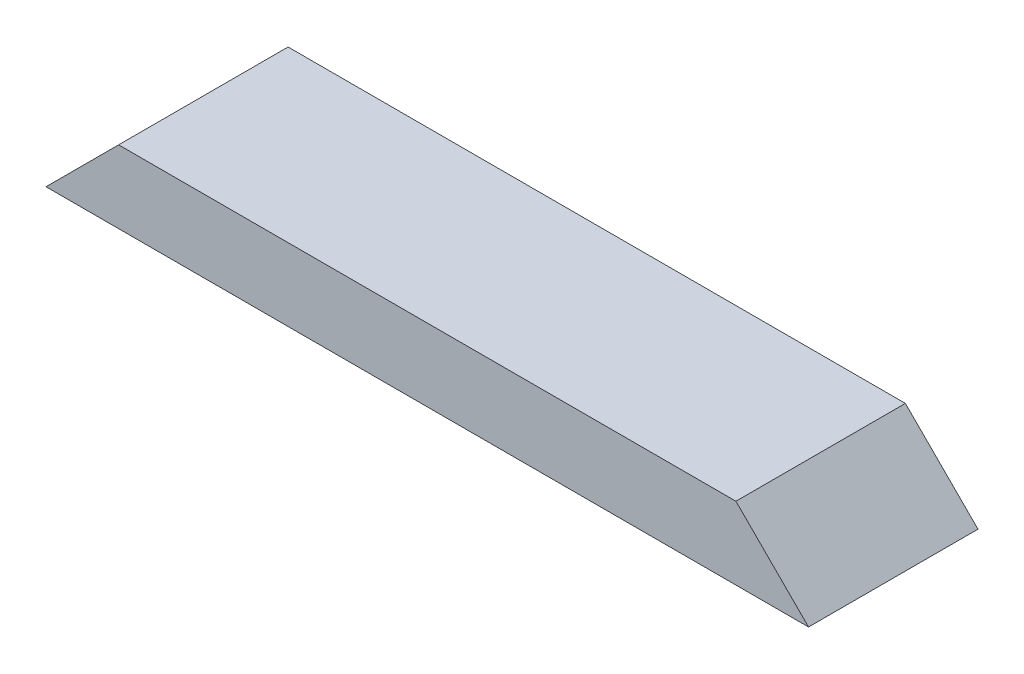
ISO-10303-21;
HEADER;
FILE_DESCRIPTION(('STEP AP214'),'2;1');
FILE_NAME('part.step','',(''),(''),'','','');
FILE_SCHEMA(('AUTOMOTIVE_DESIGN { 1 0 10303 214 1 1 1 1 }'));
ENDSEC;
DATA;
#1=APPLICATION_CONTEXT('core data for automotive mechanical design processes');
#2=APPLICATION_PROTOCOL_DEFINITION('international standard','automotive_design',2000,#1);
#3=PRODUCT_CONTEXT('',#1,'mechanical');
#4=PRODUCT('Part','Part','',(#3));
#5=PRODUCT_RELATED_PRODUCT_CATEGORY('part','',(#4));
#6=PRODUCT_DEFINITION_FORMATION('','',#4);
#7=PRODUCT_DEFINITION_CONTEXT('part definition',#1,'design');
#8=PRODUCT_DEFINITION('design','',#6,#7);
#9=PRODUCT_DEFINITION_SHAPE('','',#8);
#10=(LENGTH_UNIT() NAMED_UNIT(*) SI_UNIT(.MILLI.,.METRE.));
#11=(NAMED_UNIT(*) PLANE_ANGLE_UNIT() SI_UNIT($,.RADIAN.));
#12=(NAMED_UNIT(*) SI_UNIT($,.STERADIAN.) SOLID_ANGLE_UNIT());
#13=UNCERTAINTY_MEASURE_WITH_UNIT(LENGTH_MEASURE(1.E-05),#10,'distance_accuracy_value','');
#14=(GEOMETRIC_REPRESENTATION_CONTEXT(3) GLOBAL_UNCERTAINTY_ASSIGNED_CONTEXT((#13)) GLOBAL_UNIT_ASSIGNED_CONTEXT((#10,
#11,#12)) REPRESENTATION_CONTEXT('',''));
#15=CARTESIAN_POINT('',(0.,0.,0.));
#16=DIRECTION('',(0.,0.,1.));
#17=DIRECTION('',(1.,0.,0.));
#18=AXIS2_PLACEMENT_3D('',#15,#16,#17);
#19=CARTESIAN_POINT('',(0.,38.1,0.));
#20=DIRECTION('',(0.,0.,-1.));
#21=DIRECTION('',(-1.,0.,0.));
#22=AXIS2_PLACEMENT_3D('',#19,#20,#21);
#23=PLANE('',#22);
#24=DIRECTION('',(1.,0.,0.));
#25=VECTOR('',#24,1.);
#26=CARTESIAN_POINT('',(0.,38.1,0.));
#27=LINE('',#26,#25);
#28=CARTESIAN_POINT('',(38.1,38.1,0.));
#29=VERTEX_POINT('',#28);
#30=CARTESIAN_POINT('',(361.95,38.0999999999999,0.));
#31=VERTEX_POINT('',#30);
#32=EDGE_CURVE('E47',#29,#31,#27,.T.);
#33=ORIENTED_EDGE('',*,*,#32,.F.);
#34=DIRECTION('',(0.707106781186547,0.707106781186547,0.));
#35=VECTOR('',#34,1.);
#36=CARTESIAN_POINT('',(0.,0.,0.));
#37=LINE('',#36,#35);
#38=CARTESIAN_POINT('',(0.,0.,0.));
#39=VERTEX_POINT('',#38);
#40=EDGE_CURVE('E82',#39,#29,#37,.T.);
#41=ORIENTED_EDGE('',*,*,#40,.F.);
#42=DIRECTION('',(1.,0.,0.));
#43=VECTOR('',#42,1.);
#44=CARTESIAN_POINT('',(0.,0.,0.));
#45=LINE('',#44,#43);
#46=CARTESIAN_POINT('',(400.05,0.,0.));
#47=VERTEX_POINT('',#46);
#48=EDGE_CURVE('E87',#39,#47,#45,.T.);
#49=ORIENTED_EDGE('',*,*,#48,.T.);
#50=DIRECTION('',(0.707106781186549,-0.707106781186546,0.));
#51=VECTOR('',#50,1.);
#52=CARTESIAN_POINT('',(361.95,38.0999999999999,0.));
#53=LINE('',#52,#51);
#54=EDGE_CURVE('E63',#31,#47,#53,.T.);
#55=ORIENTED_EDGE('',*,*,#54,.F.);
#56=EDGE_LOOP('',(#33,#41,#49,#55));
#57=FACE_BOUND('',#56,.T.);
#58=ADVANCED_FACE('F39',(#57),#23,.F.);
#59=CARTESIAN_POINT('',(0.,38.1,-88.9));
#60=DIRECTION('',(0.,0.,1.));
#61=DIRECTION('',(1.,0.,0.));
#62=AXIS2_PLACEMENT_3D('',#59,#60,#61);
#63=PLANE('',#62);
#64=DIRECTION('',(-1.,0.,0.));
#65=VECTOR('',#64,1.);
#66=CARTESIAN_POINT('',(0.,0.,-88.9));
#67=LINE('',#66,#65);
#68=CARTESIAN_POINT('',(400.05,0.,-88.9));
#69=VERTEX_POINT('',#68);
#70=CARTESIAN_POINT('',(0.,0.,-88.9));
#71=VERTEX_POINT('',#70);
#72=EDGE_CURVE('E42',#69,#71,#67,.T.);
#73=ORIENTED_EDGE('',*,*,#72,.T.);
#74=DIRECTION('',(0.707106781186547,0.707106781186547,0.));
#75=VECTOR('',#74,1.);
#76=CARTESIAN_POINT('',(0.,0.,-88.9));
#77=LINE('',#76,#75);
#78=CARTESIAN_POINT('',(38.1,38.1,-88.9));
#79=VERTEX_POINT('',#78);
#80=EDGE_CURVE('E55',#71,#79,#77,.T.);
#81=ORIENTED_EDGE('',*,*,#80,.T.);
#82=DIRECTION('',(-1.,0.,0.));
#83=VECTOR('',#82,1.);
#84=CARTESIAN_POINT('',(0.,38.1,-88.9));
#85=LINE('',#84,#83);
#86=CARTESIAN_POINT('',(361.95,38.0999999999999,-88.9));
#87=VERTEX_POINT('',#86);
#88=EDGE_CURVE('E11',#87,#79,#85,.T.);
#89=ORIENTED_EDGE('',*,*,#88,.F.);
#90=DIRECTION('',(0.707106781186549,-0.707106781186546,0.));
#91=VECTOR('',#90,1.);
#92=CARTESIAN_POINT('',(361.95,38.0999999999999,-88.9));
#93=LINE('',#92,#91);
#94=EDGE_CURVE('E100',#87,#69,#93,.T.);
#95=ORIENTED_EDGE('',*,*,#94,.T.);
#96=EDGE_LOOP('',(#73,#81,#89,#95));
#97=FACE_BOUND('',#96,.T.);
#98=ADVANCED_FACE('F109',(#97),#63,.F.);
#99=CARTESIAN_POINT('',(0.,38.1,0.));
#100=DIRECTION('',(0.,-1.,0.));
#101=DIRECTION('',(0.,0.,-1.));
#102=AXIS2_PLACEMENT_3D('',#99,#100,#101);
#103=PLANE('',#102);
#104=ORIENTED_EDGE('',*,*,#88,.T.);
#105=DIRECTION('',(0.,0.,1.));
#106=VECTOR('',#105,1.);
#107=CARTESIAN_POINT('',(38.1,38.1,-88.9));
#108=LINE('',#107,#106);
#109=EDGE_CURVE('E88',#79,#29,#108,.T.);
#110=ORIENTED_EDGE('',*,*,#109,.T.);
#111=ORIENTED_EDGE('',*,*,#32,.T.);
#112=DIRECTION('',(0.,0.,1.));
#113=VECTOR('',#112,1.);
#114=CARTESIAN_POINT('',(361.95,38.0999999999999,-88.9));
#115=LINE('',#114,#113);
#116=EDGE_CURVE('E103',#87,#31,#115,.T.);
#117=ORIENTED_EDGE('',*,*,#116,.F.);
#118=EDGE_LOOP('',(#104,#110,#111,#117));
#119=FACE_BOUND('',#118,.T.);
#120=ADVANCED_FACE('F112',(#119),#103,.F.);
#121=CARTESIAN_POINT('',(0.,0.,0.));
#122=DIRECTION('',(0.,-1.,0.));
#123=DIRECTION('',(0.,0.,-1.));
#124=AXIS2_PLACEMENT_3D('',#121,#122,#123);
#125=PLANE('',#124);
#126=DIRECTION('',(0.,0.,1.));
#127=VECTOR('',#126,1.);
#128=CARTESIAN_POINT('',(0.,0.,0.));
#129=LINE('',#128,#127);
#130=EDGE_CURVE('E79',#71,#39,#129,.T.);
#131=ORIENTED_EDGE('',*,*,#130,.F.);
#132=ORIENTED_EDGE('',*,*,#72,.F.);
#133=DIRECTION('',(0.,0.,-1.));
#134=VECTOR('',#133,1.);
#135=CARTESIAN_POINT('',(400.05,0.,0.));
#136=LINE('',#135,#134);
#137=EDGE_CURVE('E96',#47,#69,#136,.T.);
#138=ORIENTED_EDGE('',*,*,#137,.F.);
#139=ORIENTED_EDGE('',*,*,#48,.F.);
#140=EDGE_LOOP('',(#131,#132,#138,#139));
#141=FACE_BOUND('',#140,.T.);
#142=ADVANCED_FACE('F95',(#141),#125,.T.);
#143=CARTESIAN_POINT('',(361.95,38.0999999999999,-88.9));
#144=DIRECTION('',(-0.707106781186546,-0.707106781186549,0.));
#145=DIRECTION('',(0.707106781186549,-0.707106781186546,0.));
#146=AXIS2_PLACEMENT_3D('',#143,#144,#145);
#147=PLANE('',#146);
#148=ORIENTED_EDGE('',*,*,#54,.T.);
#149=ORIENTED_EDGE('',*,*,#137,.T.);
#150=ORIENTED_EDGE('',*,*,#94,.F.);
#151=ORIENTED_EDGE('',*,*,#116,.T.);
#152=EDGE_LOOP('',(#148,#149,#150,#151));
#153=FACE_BOUND('',#152,.T.);
#154=ADVANCED_FACE('F113',(#153),#147,.F.);
#155=CARTESIAN_POINT('',(0.,0.,-88.9));
#156=DIRECTION('',(0.707106781186547,-0.707106781186547,0.));
#157=DIRECTION('',(0.707106781186548,0.707106781186548,0.));
#158=AXIS2_PLACEMENT_3D('',#155,#156,#157);
#159=PLANE('',#158);
#160=ORIENTED_EDGE('',*,*,#40,.T.);
#161=ORIENTED_EDGE('',*,*,#109,.F.);
#162=ORIENTED_EDGE('',*,*,#80,.F.);
#163=ORIENTED_EDGE('',*,*,#130,.T.);
#164=EDGE_LOOP('',(#160,#161,#162,#163));
#165=FACE_BOUND('',#164,.T.);
#166=ADVANCED_FACE('F81',(#165),#159,.F.);
#167=CLOSED_SHELL('',(#58,#98,#120,#142,#154,#166));
#168=MANIFOLD_SOLID_BREP('B2',#167);
#169=ADVANCED_BREP_SHAPE_REPRESENTATION('',(#18,#168),#14);
#170=SHAPE_DEFINITION_REPRESENTATION(#9,#169);
ENDSEC;
END-ISO-10303-21;
